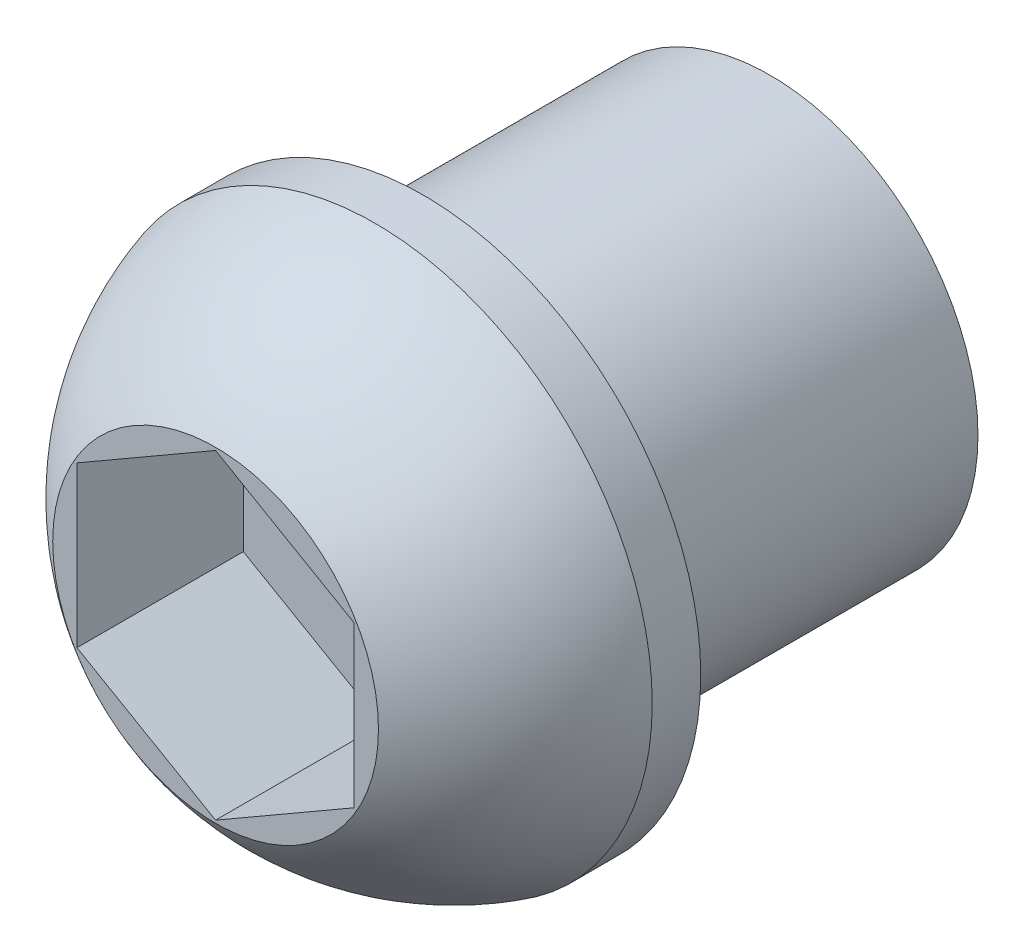
ISO-10303-21;
HEADER;
FILE_DESCRIPTION(('STEP AP214'),'2;1');
FILE_NAME('part.step','',(''),(''),'','','');
FILE_SCHEMA(('AUTOMOTIVE_DESIGN { 1 0 10303 214 1 1 1 1 }'));
ENDSEC;
DATA;
#1=APPLICATION_CONTEXT('core data for automotive mechanical design processes');
#2=APPLICATION_PROTOCOL_DEFINITION('international standard','automotive_design',2000,#1);
#3=PRODUCT_CONTEXT('',#1,'mechanical');
#4=PRODUCT('Part','Part','',(#3));
#5=PRODUCT_RELATED_PRODUCT_CATEGORY('part','',(#4));
#6=PRODUCT_DEFINITION_FORMATION('','',#4);
#7=PRODUCT_DEFINITION_CONTEXT('part definition',#1,'design');
#8=PRODUCT_DEFINITION('design','',#6,#7);
#9=PRODUCT_DEFINITION_SHAPE('','',#8);
#10=(LENGTH_UNIT() NAMED_UNIT(*) SI_UNIT(.MILLI.,.METRE.));
#11=(NAMED_UNIT(*) PLANE_ANGLE_UNIT() SI_UNIT($,.RADIAN.));
#12=(NAMED_UNIT(*) SI_UNIT($,.STERADIAN.) SOLID_ANGLE_UNIT());
#13=UNCERTAINTY_MEASURE_WITH_UNIT(LENGTH_MEASURE(1.E-05),#10,'distance_accuracy_value','');
#14=(GEOMETRIC_REPRESENTATION_CONTEXT(3) GLOBAL_UNCERTAINTY_ASSIGNED_CONTEXT((#13)) GLOBAL_UNIT_ASSIGNED_CONTEXT((#10,
#11,#12)) REPRESENTATION_CONTEXT('',''));
#15=CARTESIAN_POINT('',(0.,0.,0.));
#16=DIRECTION('',(0.,0.,1.));
#17=DIRECTION('',(1.,0.,0.));
#18=AXIS2_PLACEMENT_3D('',#15,#16,#17);
#19=CARTESIAN_POINT('',(3.31375042247443,0.,0.87155940215332));
#20=DIRECTION('',(0.,0.,-1.));
#21=DIRECTION('',(0.,-1.,0.));
#22=AXIS2_PLACEMENT_3D('',#19,#20,#21);
#23=PLANE('',#22);
#24=CARTESIAN_POINT('',(-0.686249578025567,0.,0.871559402153313));
#25=DIRECTION('',(0.,0.,1.));
#26=DIRECTION('',(1.,0.,0.));
#27=AXIS2_PLACEMENT_3D('',#24,#25,#26);
#28=CIRCLE('',#27,3.);
#29=CARTESIAN_POINT('',(2.31375042197443,0.,0.871559402153313));
#30=VERTEX_POINT('',#29);
#31=EDGE_CURVE('E11',#30,#30,#28,.T.);
#32=ORIENTED_EDGE('',*,*,#31,.T.);
#33=EDGE_LOOP('',(#32));
#34=FACE_BOUND('',#33,.T.);
#35=CARTESIAN_POINT('',(-0.686249578025567,0.,0.87155940215332));
#36=DIRECTION('',(0.,0.,1.));
#37=DIRECTION('',(1.,0.,0.));
#38=AXIS2_PLACEMENT_3D('',#35,#36,#37);
#39=CIRCLE('',#38,4.00000000049999);
#40=CARTESIAN_POINT('',(3.31375042247443,0.,0.87155940215332));
#41=VERTEX_POINT('',#40);
#42=EDGE_CURVE('E123',#41,#41,#39,.T.);
#43=ORIENTED_EDGE('',*,*,#42,.F.);
#44=EDGE_LOOP('',(#43));
#45=FACE_BOUND('',#44,.T.);
#46=ADVANCED_FACE('F16',(#34,#45),#23,.T.);
#47=CARTESIAN_POINT('',(-0.686249578025567,0.,-3.97844059784669));
#48=DIRECTION('',(0.,0.,1.));
#49=DIRECTION('',(1.,0.,0.));
#50=AXIS2_PLACEMENT_3D('',#47,#48,#49);
#51=CYLINDRICAL_SURFACE('',#50,3.);
#52=ORIENTED_EDGE('',*,*,#31,.F.);
#53=EDGE_LOOP('',(#52));
#54=FACE_BOUND('',#53,.T.);
#55=CARTESIAN_POINT('',(-0.686249578025567,0.,-4.12844059784668));
#56=DIRECTION('',(0.,0.,1.));
#57=DIRECTION('',(1.,0.,0.));
#58=AXIS2_PLACEMENT_3D('',#55,#56,#57);
#59=CIRCLE('',#58,3.);
#60=CARTESIAN_POINT('',(-3.68624957802557,0.,-4.12844059784668));
#61=VERTEX_POINT('',#60);
#62=EDGE_CURVE('E148',#61,#61,#59,.T.);
#63=ORIENTED_EDGE('',*,*,#62,.T.);
#64=EDGE_LOOP('',(#63));
#65=FACE_BOUND('',#64,.T.);
#66=ADVANCED_FACE('F241',(#54,#65),#51,.T.);
#67=CARTESIAN_POINT('',(-0.686249578025567,0.,3.87155940215332));
#68=DIRECTION('',(0.,0.,1.));
#69=DIRECTION('',(1.,0.,0.));
#70=AXIS2_PLACEMENT_3D('',#67,#68,#69);
#71=PLANE('',#70);
#72=DIRECTION('',(0.,1.,0.));
#73=VECTOR('',#72,1.);
#74=CARTESIAN_POINT('',(-2.68624957511882,-0.577350268350522,3.87155940215332));
#75=LINE('',#74,#73);
#76=CARTESIAN_POINT('',(-2.68624957511882,-1.15470053670104,3.87155940215332));
#77=VERTEX_POINT('',#76);
#78=CARTESIAN_POINT('',(-2.68624957511882,1.15470053670104,3.87155940215332));
#79=VERTEX_POINT('',#78);
#80=EDGE_CURVE('E144',#77,#79,#75,.T.);
#81=ORIENTED_EDGE('',*,*,#80,.T.);
#82=DIRECTION('',(0.866025403784441,0.5,0.));
#83=VECTOR('',#82,1.);
#84=CARTESIAN_POINT('',(-2.1862495758455,1.4433756708763,3.87155940215332));
#85=LINE('',#84,#83);
#86=CARTESIAN_POINT('',(-0.686249578025567,2.30940107340207,3.87155940215332));
#87=VERTEX_POINT('',#86);
#88=EDGE_CURVE('E186',#79,#87,#85,.T.);
#89=ORIENTED_EDGE('',*,*,#88,.T.);
#90=DIRECTION('',(0.866025403784442,-0.5,0.));
#91=VECTOR('',#90,1.);
#92=CARTESIAN_POINT('',(-0.18624957875226,2.02072593922682,3.87155940215332));
#93=LINE('',#92,#91);
#94=CARTESIAN_POINT('',(1.31375041906769,1.15470053670104,3.87155940215332));
#95=VERTEX_POINT('',#94);
#96=EDGE_CURVE('E166',#87,#95,#93,.T.);
#97=ORIENTED_EDGE('',*,*,#96,.T.);
#98=DIRECTION('',(0.,-1.,0.));
#99=VECTOR('',#98,1.);
#100=CARTESIAN_POINT('',(1.31375041906769,0.577350268350522,3.87155940215332));
#101=LINE('',#100,#99);
#102=CARTESIAN_POINT('',(1.31375041906769,-1.15470053670104,3.87155940215332));
#103=VERTEX_POINT('',#102);
#104=EDGE_CURVE('E174',#95,#103,#101,.T.);
#105=ORIENTED_EDGE('',*,*,#104,.T.);
#106=DIRECTION('',(-0.866025403784441,-0.5,0.));
#107=VECTOR('',#106,1.);
#108=CARTESIAN_POINT('',(0.813750419794369,-1.4433756708763,3.87155940215332));
#109=LINE('',#108,#107);
#110=CARTESIAN_POINT('',(-0.686249578025567,-2.30940107340207,3.87155940215332));
#111=VERTEX_POINT('',#110);
#112=EDGE_CURVE('E135',#103,#111,#109,.T.);
#113=ORIENTED_EDGE('',*,*,#112,.T.);
#114=DIRECTION('',(-0.866025403784441,0.5,0.));
#115=VECTOR('',#114,1.);
#116=CARTESIAN_POINT('',(-1.18624957729888,-2.02072593922682,3.87155940215332));
#117=LINE('',#116,#115);
#118=EDGE_CURVE('E143',#111,#77,#117,.T.);
#119=ORIENTED_EDGE('',*,*,#118,.T.);
#120=EDGE_LOOP('',(#81,#89,#97,#105,#113,#119));
#121=FACE_BOUND('',#120,.T.);
#122=CARTESIAN_POINT('',(-0.686249578025567,0.,3.87155940215332));
#123=DIRECTION('',(0.,0.,1.));
#124=DIRECTION('',(1.,0.,0.));
#125=AXIS2_PLACEMENT_3D('',#122,#123,#124);
#126=CIRCLE('',#125,2.35);
#127=CARTESIAN_POINT('',(1.66375042197443,0.,3.87155940215332));
#128=VERTEX_POINT('',#127);
#129=CARTESIAN_POINT('',(-3.03624956971329,-9.18151745255254E-10,3.87155940786334));
#130=VERTEX_POINT('',#129);
#131=EDGE_CURVE('E113',#128,#130,#126,.T.);
#132=ORIENTED_EDGE('',*,*,#131,.T.);
#133=CARTESIAN_POINT('',(-0.686249578025567,0.,3.87155940215332));
#134=DIRECTION('',(0.,0.,1.));
#135=DIRECTION('',(1.,0.,0.));
#136=AXIS2_PLACEMENT_3D('',#133,#134,#135);
#137=CIRCLE('',#136,2.35);
#138=EDGE_CURVE('E27',#130,#128,#137,.T.);
#139=ORIENTED_EDGE('',*,*,#138,.T.);
#140=EDGE_LOOP('',(#132,#139));
#141=FACE_BOUND('',#140,.T.);
#142=ADVANCED_FACE('F117',(#121,#141),#71,.T.);
#143=CARTESIAN_POINT('',(-4.68624957868715,-3.02115585523167E-10,1.57155940159331));
#144=CARTESIAN_POINT('',(-4.68624957868715,-4.00000000225484,1.57155940052194));
#145=CARTESIAN_POINT('',(-0.686249576734425,-4.00000000225484,1.57155939595137));
#146=CARTESIAN_POINT('',(3.3137504252183,-4.00000000225484,1.5715593913808));
#147=CARTESIAN_POINT('',(3.3137504252183,-3.02115585523167E-10,1.57155939245217));
#148=CARTESIAN_POINT('',(3.3137504252183,4.0000000016506,1.57155939352353));
#149=CARTESIAN_POINT('',(-0.686249576734425,4.00000000165061,1.5715593980941));
#150=CARTESIAN_POINT('',(-4.68624957868715,4.0000000016506,1.57155940266468));
#151=CARTESIAN_POINT('',(-4.68624957868715,-3.02115585523167E-10,1.57155940159331));
#152=CARTESIAN_POINT('',(-4.2752305433572,-6.89679025617539E-10,3.01854575297264));
#153=CARTESIAN_POINT('',(-4.2752305433572,-3.58898096896584,3.01854575201136));
#154=CARTESIAN_POINT('',(-0.686249575081037,-3.58898096896584,3.01854574791043));
#155=CARTESIAN_POINT('',(2.90273139319513,-3.58898096896584,3.01854574380951));
#156=CARTESIAN_POINT('',(2.90273139319513,-6.89679025617538E-10,3.01854574477079));
#157=CARTESIAN_POINT('',(2.90273139319513,3.58898096758648,3.01854574573207));
#158=CARTESIAN_POINT('',(-0.686249575081037,3.58898096758648,3.01854574983299));
#159=CARTESIAN_POINT('',(-4.2752305433572,3.58898096758648,3.01854575393391));
#160=CARTESIAN_POINT('',(-4.2752305433572,-6.89679025617539E-10,3.01854575297264));
#161=CARTESIAN_POINT('',(-3.03624956971329,-9.18151745255254E-10,3.87155940786334));
#162=CARTESIAN_POINT('',(-3.03624956971329,-2.34999999652509,3.87155940723391));
#163=CARTESIAN_POINT('',(-0.686249574106347,-2.34999999652509,3.8715594045487));
#164=CARTESIAN_POINT('',(1.66375042150059,-2.34999999652509,3.87155940186349));
#165=CARTESIAN_POINT('',(1.66375042150059,-9.18151745255254E-10,3.87155940249291));
#166=CARTESIAN_POINT('',(1.66375042150059,2.34999999468879,3.87155940312234));
#167=CARTESIAN_POINT('',(-0.686249574106347,2.34999999468879,3.87155940580755));
#168=CARTESIAN_POINT('',(-3.03624956971329,2.34999999468879,3.87155940849276));
#169=CARTESIAN_POINT('',(-3.03624956971329,-9.18151745255254E-10,3.87155940786334));
#170=(BOUNDED_SURFACE() B_SPLINE_SURFACE(2,2,((#143,#144,#145,#146,#147,#148,#149,#150,#151),
(#152,#153,#154,#155,#156,#157,#158,#159,#160),(#161,#162,#163,#164,#165,#166,#167,#168,#169)),
.UNSPECIFIED.,.F.,.T.,.F.) B_SPLINE_SURFACE_WITH_KNOTS((3,3),(3,2,2,2,3),(0.276761941622089,
0.967843801036609),(-3.14159265358979,-1.5707963267949,0.,1.5707963267949,3.14159265358979),
.UNSPECIFIED.) GEOMETRIC_REPRESENTATION_ITEM() RATIONAL_B_SPLINE_SURFACE(((1.,0.707106781186548,
1.,0.707106781186548,1.,0.707106781186548,1.,0.707106781186548,1.),(0.94089237430415,
0.665311378237176,0.94089237430415,0.665311378237176,0.94089237430415,0.665311378237176,
0.94089237430415,0.665311378237176,0.94089237430415),(1.,0.707106781186548,1.,0.707106781186548,
1.,0.707106781186548,1.,0.707106781186548,1.))) REPRESENTATION_ITEM('') SURFACE());
#171=CARTESIAN_POINT('',(-0.686249578025567,0.,1.57155940215331));
#172=DIRECTION('',(0.,0.,1.));
#173=DIRECTION('',(1.,0.,0.));
#174=AXIS2_PLACEMENT_3D('',#171,#172,#173);
#175=CIRCLE('',#174,4.00000000049999);
#176=CARTESIAN_POINT('',(3.31375042247443,0.,1.57155940215331));
#177=VERTEX_POINT('',#176);
#178=CARTESIAN_POINT('',(-4.68624957868715,-3.02115585523167E-10,1.57155940159331));
#179=VERTEX_POINT('',#178);
#180=EDGE_CURVE('E121',#177,#179,#175,.T.);
#181=CARTESIAN_POINT('',(-4.68624957868715,-3.02115585523167E-10,1.57155940159331));
#182=CARTESIAN_POINT('',(-4.2752305433572,-6.89679025617539E-10,3.01854575297264));
#183=CARTESIAN_POINT('',(-3.03624956971329,-9.18151745255254E-10,3.87155940786334));
#184=(BOUNDED_CURVE() B_SPLINE_CURVE(2,(#181,#182,#183),.UNSPECIFIED.,.F.,
.F.) B_SPLINE_CURVE_WITH_KNOTS((3,3),(0.276761941622089,0.967843801036609),
.UNSPECIFIED.) CURVE() GEOMETRIC_REPRESENTATION_ITEM() RATIONAL_B_SPLINE_CURVE((1.,
0.94089237430415,1.)) REPRESENTATION_ITEM(''));
#185=EDGE_CURVE('E111',#179,#130,#184,.T.);
#186=CARTESIAN_POINT('',(-0.686249578025567,0.,1.57155940215331));
#187=DIRECTION('',(0.,0.,1.));
#188=DIRECTION('',(1.,0.,0.));
#189=AXIS2_PLACEMENT_3D('',#186,#187,#188);
#190=CIRCLE('',#189,4.00000000049999);
#191=EDGE_CURVE('E129',#179,#177,#190,.T.);
#192=ORIENTED_EDGE('',*,*,#180,.T.);
#193=ORIENTED_EDGE('',*,*,#185,.T.);
#194=ORIENTED_EDGE('',*,*,#131,.F.);
#195=ORIENTED_EDGE('',*,*,#138,.F.);
#196=ORIENTED_EDGE('',*,*,#185,.F.);
#197=ORIENTED_EDGE('',*,*,#191,.T.);
#198=EDGE_LOOP('',(#192,#193,#194,#195,#196,#197));
#199=FACE_BOUND('',#198,.T.);
#200=ADVANCED_FACE('F109',(#199),#170,.F.);
#201=CARTESIAN_POINT('',(-0.686249578025567,0.,1.22155940215331));
#202=DIRECTION('',(0.,0.,1.));
#203=DIRECTION('',(1.,0.,0.));
#204=AXIS2_PLACEMENT_3D('',#201,#202,#203);
#205=CYLINDRICAL_SURFACE('',#204,4.00000000049999);
#206=ORIENTED_EDGE('',*,*,#42,.T.);
#207=EDGE_LOOP('',(#206));
#208=FACE_BOUND('',#207,.T.);
#209=ORIENTED_EDGE('',*,*,#180,.F.);
#210=ORIENTED_EDGE('',*,*,#191,.F.);
#211=EDGE_LOOP('',(#209,#210));
#212=FACE_BOUND('',#211,.T.);
#213=ADVANCED_FACE('F18',(#208,#212),#205,.T.);
#214=CARTESIAN_POINT('',(-0.686249578025567,0.,1.47155940215332));
#215=DIRECTION('',(0.,0.,-1.));
#216=DIRECTION('',(0.,-1.,0.));
#217=AXIS2_PLACEMENT_3D('',#214,#215,#216);
#218=PLANE('',#217);
#219=DIRECTION('',(0.866025403784442,0.5,0.));
#220=VECTOR('',#219,1.);
#221=CARTESIAN_POINT('',(-2.68624957511882,1.15470053670104,1.47155940215332));
#222=LINE('',#221,#220);
#223=CARTESIAN_POINT('',(-2.68624957511882,1.15470053670104,1.47155940215332));
#224=VERTEX_POINT('',#223);
#225=CARTESIAN_POINT('',(-0.686249578025567,2.30940107340207,1.47155940215332));
#226=VERTEX_POINT('',#225);
#227=EDGE_CURVE('E176',#224,#226,#222,.T.);
#228=ORIENTED_EDGE('',*,*,#227,.F.);
#229=DIRECTION('',(0.,1.,0.));
#230=VECTOR('',#229,1.);
#231=CARTESIAN_POINT('',(-2.68624957511882,-1.15470053670104,1.47155940215332));
#232=LINE('',#231,#230);
#233=CARTESIAN_POINT('',(-2.68624957511882,-1.15470053670104,1.47155940215332));
#234=VERTEX_POINT('',#233);
#235=EDGE_CURVE('E155',#234,#224,#232,.T.);
#236=ORIENTED_EDGE('',*,*,#235,.F.);
#237=DIRECTION('',(-0.866025403784441,0.5,0.));
#238=VECTOR('',#237,1.);
#239=CARTESIAN_POINT('',(-0.686249578025567,-2.30940107340207,1.47155940215332));
#240=LINE('',#239,#238);
#241=CARTESIAN_POINT('',(-0.686249578025567,-2.30940107340207,1.47155940215332));
#242=VERTEX_POINT('',#241);
#243=EDGE_CURVE('E142',#242,#234,#240,.T.);
#244=ORIENTED_EDGE('',*,*,#243,.F.);
#245=DIRECTION('',(-0.866025403784441,-0.5,0.));
#246=VECTOR('',#245,1.);
#247=CARTESIAN_POINT('',(1.31375041906769,-1.15470053670104,1.47155940215332));
#248=LINE('',#247,#246);
#249=CARTESIAN_POINT('',(1.31375041906769,-1.15470053670104,1.47155940215332));
#250=VERTEX_POINT('',#249);
#251=EDGE_CURVE('E192',#250,#242,#248,.T.);
#252=ORIENTED_EDGE('',*,*,#251,.F.);
#253=DIRECTION('',(0.,-1.,0.));
#254=VECTOR('',#253,1.);
#255=CARTESIAN_POINT('',(1.31375041906769,1.15470053670104,1.47155940215332));
#256=LINE('',#255,#254);
#257=CARTESIAN_POINT('',(1.31375041906769,1.15470053670104,1.47155940215332));
#258=VERTEX_POINT('',#257);
#259=EDGE_CURVE('E20',#258,#250,#256,.T.);
#260=ORIENTED_EDGE('',*,*,#259,.F.);
#261=DIRECTION('',(0.866025403784442,-0.5,0.));
#262=VECTOR('',#261,1.);
#263=CARTESIAN_POINT('',(-0.686249578025567,2.30940107340207,1.47155940215332));
#264=LINE('',#263,#262);
#265=EDGE_CURVE('E183',#226,#258,#264,.T.);
#266=ORIENTED_EDGE('',*,*,#265,.F.);
#267=EDGE_LOOP('',(#228,#236,#244,#252,#260,#266));
#268=FACE_BOUND('',#267,.T.);
#269=ADVANCED_FACE('F217',(#268),#218,.F.);
#270=CARTESIAN_POINT('',(-2.68624957511882,1.15470053670104,3.87155940215332));
#271=DIRECTION('',(-0.5,0.866025403784442,0.));
#272=DIRECTION('',(0.,0.,1.));
#273=AXIS2_PLACEMENT_3D('',#270,#271,#272);
#274=PLANE('',#273);
#275=ORIENTED_EDGE('',*,*,#88,.F.);
#276=DIRECTION('',(0.,0.,-1.));
#277=VECTOR('',#276,1.);
#278=CARTESIAN_POINT('',(-2.68624957511882,1.15470053670104,3.87155940215332));
#279=LINE('',#278,#277);
#280=EDGE_CURVE('E165',#79,#224,#279,.T.);
#281=ORIENTED_EDGE('',*,*,#280,.T.);
#282=ORIENTED_EDGE('',*,*,#227,.T.);
#283=DIRECTION('',(0.,0.,-1.));
#284=VECTOR('',#283,1.);
#285=CARTESIAN_POINT('',(-0.686249578025567,2.30940107340207,3.87155940215332));
#286=LINE('',#285,#284);
#287=EDGE_CURVE('E168',#87,#226,#286,.T.);
#288=ORIENTED_EDGE('',*,*,#287,.F.);
#289=EDGE_LOOP('',(#275,#281,#282,#288));
#290=FACE_BOUND('',#289,.T.);
#291=ADVANCED_FACE('F211',(#290),#274,.F.);
#292=CARTESIAN_POINT('',(-0.686249578025567,2.30940107340207,3.87155940215332));
#293=DIRECTION('',(0.5,0.866025403784442,0.));
#294=DIRECTION('',(0.,0.,-1.));
#295=AXIS2_PLACEMENT_3D('',#292,#293,#294);
#296=PLANE('',#295);
#297=ORIENTED_EDGE('',*,*,#96,.F.);
#298=ORIENTED_EDGE('',*,*,#287,.T.);
#299=ORIENTED_EDGE('',*,*,#265,.T.);
#300=DIRECTION('',(0.,0.,-1.));
#301=VECTOR('',#300,1.);
#302=CARTESIAN_POINT('',(1.31375041906769,1.15470053670104,3.87155940215332));
#303=LINE('',#302,#301);
#304=EDGE_CURVE('E170',#95,#258,#303,.T.);
#305=ORIENTED_EDGE('',*,*,#304,.F.);
#306=EDGE_LOOP('',(#297,#298,#299,#305));
#307=FACE_BOUND('',#306,.T.);
#308=ADVANCED_FACE('F221',(#307),#296,.F.);
#309=CARTESIAN_POINT('',(1.31375041906769,1.15470053670104,3.87155940215332));
#310=DIRECTION('',(1.,0.,0.));
#311=DIRECTION('',(0.,1.,0.));
#312=AXIS2_PLACEMENT_3D('',#309,#310,#311);
#313=PLANE('',#312);
#314=ORIENTED_EDGE('',*,*,#104,.F.);
#315=ORIENTED_EDGE('',*,*,#304,.T.);
#316=ORIENTED_EDGE('',*,*,#259,.T.);
#317=DIRECTION('',(0.,0.,-1.));
#318=VECTOR('',#317,1.);
#319=CARTESIAN_POINT('',(1.31375041906769,-1.15470053670104,3.87155940215332));
#320=LINE('',#319,#318);
#321=EDGE_CURVE('E194',#103,#250,#320,.T.);
#322=ORIENTED_EDGE('',*,*,#321,.F.);
#323=EDGE_LOOP('',(#314,#315,#316,#322));
#324=FACE_BOUND('',#323,.T.);
#325=ADVANCED_FACE('F236',(#324),#313,.F.);
#326=CARTESIAN_POINT('',(1.31375041906769,-1.15470053670104,3.87155940215332));
#327=DIRECTION('',(0.5,-0.866025403784441,0.));
#328=DIRECTION('',(0.,0.,-1.));
#329=AXIS2_PLACEMENT_3D('',#326,#327,#328);
#330=PLANE('',#329);
#331=ORIENTED_EDGE('',*,*,#112,.F.);
#332=ORIENTED_EDGE('',*,*,#321,.T.);
#333=ORIENTED_EDGE('',*,*,#251,.T.);
#334=DIRECTION('',(0.,0.,-1.));
#335=VECTOR('',#334,1.);
#336=CARTESIAN_POINT('',(-0.686249578025567,-2.30940107340207,3.87155940215332));
#337=LINE('',#336,#335);
#338=EDGE_CURVE('E137',#111,#242,#337,.T.);
#339=ORIENTED_EDGE('',*,*,#338,.F.);
#340=EDGE_LOOP('',(#331,#332,#333,#339));
#341=FACE_BOUND('',#340,.T.);
#342=ADVANCED_FACE('F234',(#341),#330,.F.);
#343=CARTESIAN_POINT('',(-0.686249578025567,-2.30940107340207,3.87155940215332));
#344=DIRECTION('',(-0.5,-0.866025403784441,0.));
#345=DIRECTION('',(-0.866025403784441,0.5,0.));
#346=AXIS2_PLACEMENT_3D('',#343,#344,#345);
#347=PLANE('',#346);
#348=ORIENTED_EDGE('',*,*,#118,.F.);
#349=ORIENTED_EDGE('',*,*,#338,.T.);
#350=ORIENTED_EDGE('',*,*,#243,.T.);
#351=DIRECTION('',(0.,0.,-1.));
#352=VECTOR('',#351,1.);
#353=CARTESIAN_POINT('',(-2.68624957511882,-1.15470053670104,3.87155940215332));
#354=LINE('',#353,#352);
#355=EDGE_CURVE('E147',#77,#234,#354,.T.);
#356=ORIENTED_EDGE('',*,*,#355,.F.);
#357=EDGE_LOOP('',(#348,#349,#350,#356));
#358=FACE_BOUND('',#357,.T.);
#359=ADVANCED_FACE('F231',(#358),#347,.F.);
#360=CARTESIAN_POINT('',(-2.68624957511882,-1.15470053670104,3.87155940215332));
#361=DIRECTION('',(-1.,0.,0.));
#362=DIRECTION('',(0.,0.,1.));
#363=AXIS2_PLACEMENT_3D('',#360,#361,#362);
#364=PLANE('',#363);
#365=ORIENTED_EDGE('',*,*,#80,.F.);
#366=ORIENTED_EDGE('',*,*,#355,.T.);
#367=ORIENTED_EDGE('',*,*,#235,.T.);
#368=ORIENTED_EDGE('',*,*,#280,.F.);
#369=EDGE_LOOP('',(#365,#366,#367,#368));
#370=FACE_BOUND('',#369,.T.);
#371=ADVANCED_FACE('F225',(#370),#364,.F.);
#372=CARTESIAN_POINT('',(-0.686249578025567,0.,-4.12844059784668));
#373=DIRECTION('',(0.,0.,1.));
#374=DIRECTION('',(1.,0.,0.));
#375=AXIS2_PLACEMENT_3D('',#372,#373,#374);
#376=PLANE('',#375);
#377=ORIENTED_EDGE('',*,*,#62,.F.);
#378=EDGE_LOOP('',(#377));
#379=FACE_BOUND('',#378,.T.);
#380=ADVANCED_FACE('F259',(#379),#376,.F.);
#381=CLOSED_SHELL('',(#46,#66,#142,#200,#213,#269,#291,#308,#325,#342,#359,#371,#380));
#382=MANIFOLD_SOLID_BREP('B1',#381);
#383=ADVANCED_BREP_SHAPE_REPRESENTATION('',(#18,#382),#14);
#384=SHAPE_DEFINITION_REPRESENTATION(#9,#383);
ENDSEC;
END-ISO-10303-21;
